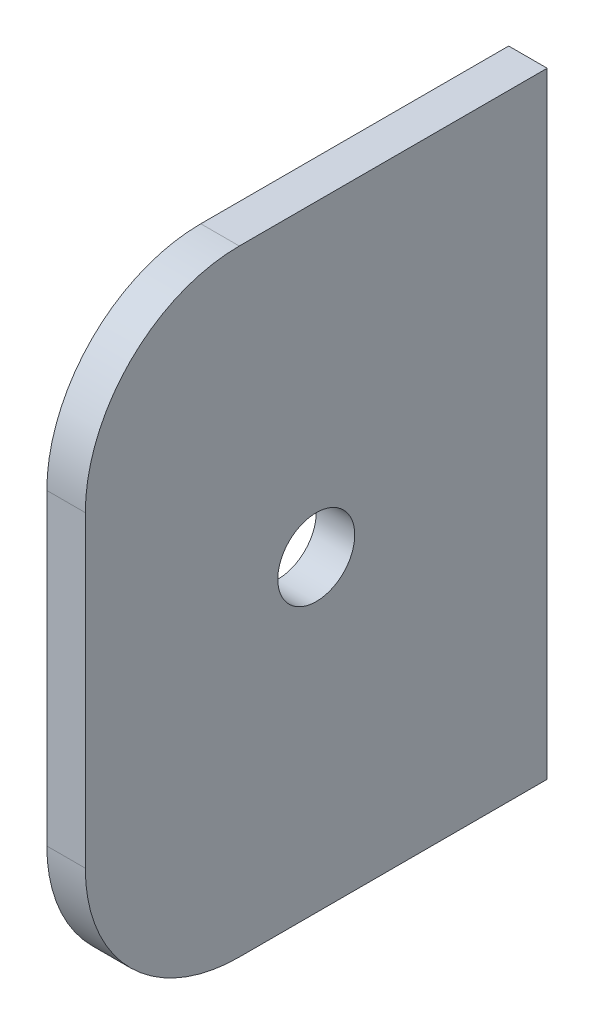
ISO-10303-21;
HEADER;
FILE_DESCRIPTION(('STEP AP214'),'2;1');
FILE_NAME('part.step','',(''),(''),'','','');
FILE_SCHEMA(('AUTOMOTIVE_DESIGN { 1 0 10303 214 1 1 1 1 }'));
ENDSEC;
DATA;
#1=APPLICATION_CONTEXT('core data for automotive mechanical design processes');
#2=APPLICATION_PROTOCOL_DEFINITION('international standard','automotive_design',2000,#1);
#3=PRODUCT_CONTEXT('',#1,'mechanical');
#4=PRODUCT('Part','Part','',(#3));
#5=PRODUCT_RELATED_PRODUCT_CATEGORY('part','',(#4));
#6=PRODUCT_DEFINITION_FORMATION('','',#4);
#7=PRODUCT_DEFINITION_CONTEXT('part definition',#1,'design');
#8=PRODUCT_DEFINITION('design','',#6,#7);
#9=PRODUCT_DEFINITION_SHAPE('','',#8);
#10=(LENGTH_UNIT() NAMED_UNIT(*) SI_UNIT(.MILLI.,.METRE.));
#11=(NAMED_UNIT(*) PLANE_ANGLE_UNIT() SI_UNIT($,.RADIAN.));
#12=(NAMED_UNIT(*) SI_UNIT($,.STERADIAN.) SOLID_ANGLE_UNIT());
#13=UNCERTAINTY_MEASURE_WITH_UNIT(LENGTH_MEASURE(1.E-05),#10,'distance_accuracy_value','');
#14=(GEOMETRIC_REPRESENTATION_CONTEXT(3) GLOBAL_UNCERTAINTY_ASSIGNED_CONTEXT((#13)) GLOBAL_UNIT_ASSIGNED_CONTEXT((#10,
#11,#12)) REPRESENTATION_CONTEXT('',''));
#15=CARTESIAN_POINT('',(0.,0.,0.));
#16=DIRECTION('',(0.,0.,1.));
#17=DIRECTION('',(1.,0.,0.));
#18=AXIS2_PLACEMENT_3D('',#15,#16,#17);
#19=CARTESIAN_POINT('',(19.05,1.016,38.1));
#20=DIRECTION('',(0.,-1.,0.));
#21=DIRECTION('',(1.,0.,0.));
#22=AXIS2_PLACEMENT_3D('',#19,#20,#21);
#23=PLANE('',#22);
#24=DIRECTION('',(0.,0.,-1.));
#25=VECTOR('',#24,1.);
#26=CARTESIAN_POINT('',(15.875,1.016,38.1));
#27=LINE('',#26,#25);
#28=CARTESIAN_POINT('',(15.875,1.016,25.4));
#29=VERTEX_POINT('',#28);
#30=CARTESIAN_POINT('',(15.875,1.016,0.));
#31=VERTEX_POINT('',#30);
#32=EDGE_CURVE('E88',#29,#31,#27,.T.);
#33=ORIENTED_EDGE('',*,*,#32,.F.);
#34=DIRECTION('',(-1.,0.,0.));
#35=VECTOR('',#34,1.);
#36=CARTESIAN_POINT('',(19.05,1.016,25.4));
#37=LINE('',#36,#35);
#38=CARTESIAN_POINT('',(19.05,1.016,25.4));
#39=VERTEX_POINT('',#38);
#40=EDGE_CURVE('E57',#29,#39,#37,.F.);
#41=ORIENTED_EDGE('',*,*,#40,.T.);
#42=DIRECTION('',(0.,0.,-1.));
#43=VECTOR('',#42,1.);
#44=CARTESIAN_POINT('',(19.05,1.016,38.1));
#45=LINE('',#44,#43);
#46=CARTESIAN_POINT('',(19.05,1.016,0.));
#47=VERTEX_POINT('',#46);
#48=EDGE_CURVE('E109',#39,#47,#45,.T.);
#49=ORIENTED_EDGE('',*,*,#48,.T.);
#50=DIRECTION('',(-1.,0.,0.));
#51=VECTOR('',#50,1.);
#52=CARTESIAN_POINT('',(19.05,1.016,0.));
#53=LINE('',#52,#51);
#54=EDGE_CURVE('E104',#47,#31,#53,.T.);
#55=ORIENTED_EDGE('',*,*,#54,.T.);
#56=EDGE_LOOP('',(#33,#41,#49,#55));
#57=FACE_BOUND('',#56,.T.);
#58=ADVANCED_FACE('F34',(#57),#23,.F.);
#59=CARTESIAN_POINT('',(15.875,1.016,38.1));
#60=DIRECTION('',(1.,0.,0.));
#61=DIRECTION('',(0.,1.,0.));
#62=AXIS2_PLACEMENT_3D('',#59,#60,#61);
#63=PLANE('',#62);
#64=CARTESIAN_POINT('',(15.875,-24.384,19.05));
#65=DIRECTION('',(-1.,0.,0.));
#66=DIRECTION('',(0.,-1.,0.));
#67=AXIS2_PLACEMENT_3D('',#64,#65,#66);
#68=CIRCLE('',#67,3.175);
#69=CARTESIAN_POINT('',(15.875,-27.559,19.05));
#70=VERTEX_POINT('',#69);
#71=EDGE_CURVE('E113',#70,#70,#68,.T.);
#72=ORIENTED_EDGE('',*,*,#71,.F.);
#73=EDGE_LOOP('',(#72));
#74=FACE_BOUND('',#73,.T.);
#75=DIRECTION('',(0.,-1.,0.));
#76=VECTOR('',#75,1.);
#77=CARTESIAN_POINT('',(15.875,1.016,38.1));
#78=LINE('',#77,#76);
#79=CARTESIAN_POINT('',(15.875,-11.684,38.1));
#80=VERTEX_POINT('',#79);
#81=CARTESIAN_POINT('',(15.875,-37.084,38.1));
#82=VERTEX_POINT('',#81);
#83=EDGE_CURVE('E122',#80,#82,#78,.T.);
#84=ORIENTED_EDGE('',*,*,#83,.F.);
#85=CARTESIAN_POINT('',(15.875,-11.684,25.4));
#86=DIRECTION('',(1.,0.,0.));
#87=DIRECTION('',(0.,1.,0.));
#88=AXIS2_PLACEMENT_3D('',#85,#86,#87);
#89=CIRCLE('',#88,12.7);
#90=EDGE_CURVE('E95',#80,#29,#89,.F.);
#91=ORIENTED_EDGE('',*,*,#90,.T.);
#92=ORIENTED_EDGE('',*,*,#32,.T.);
#93=DIRECTION('',(0.,-1.,0.));
#94=VECTOR('',#93,1.);
#95=CARTESIAN_POINT('',(15.875,1.016,0.));
#96=LINE('',#95,#94);
#97=CARTESIAN_POINT('',(15.875,-49.784,0.));
#98=VERTEX_POINT('',#97);
#99=EDGE_CURVE('E93',#31,#98,#96,.T.);
#100=ORIENTED_EDGE('',*,*,#99,.T.);
#101=DIRECTION('',(0.,0.,-1.));
#102=VECTOR('',#101,1.);
#103=CARTESIAN_POINT('',(15.875,-49.784,38.1));
#104=LINE('',#103,#102);
#105=CARTESIAN_POINT('',(15.875,-49.784,25.4));
#106=VERTEX_POINT('',#105);
#107=EDGE_CURVE('E98',#106,#98,#104,.T.);
#108=ORIENTED_EDGE('',*,*,#107,.F.);
#109=CARTESIAN_POINT('',(15.875,-37.084,25.4));
#110=DIRECTION('',(1.,0.,0.));
#111=DIRECTION('',(0.,1.,0.));
#112=AXIS2_PLACEMENT_3D('',#109,#110,#111);
#113=CIRCLE('',#112,12.7);
#114=EDGE_CURVE('E131',#106,#82,#113,.F.);
#115=ORIENTED_EDGE('',*,*,#114,.T.);
#116=EDGE_LOOP('',(#84,#91,#92,#100,#108,#115));
#117=FACE_BOUND('',#116,.T.);
#118=ADVANCED_FACE('F91',(#74,#117),#63,.F.);
#119=CARTESIAN_POINT('',(19.05,-49.784,38.1));
#120=DIRECTION('',(0.,-1.,0.));
#121=DIRECTION('',(0.,0.,-1.));
#122=AXIS2_PLACEMENT_3D('',#119,#120,#121);
#123=PLANE('',#122);
#124=DIRECTION('',(0.,0.,-1.));
#125=VECTOR('',#124,1.);
#126=CARTESIAN_POINT('',(19.05,-49.784,38.1));
#127=LINE('',#126,#125);
#128=CARTESIAN_POINT('',(19.05,-49.784,25.4));
#129=VERTEX_POINT('',#128);
#130=CARTESIAN_POINT('',(19.05,-49.784,0.));
#131=VERTEX_POINT('',#130);
#132=EDGE_CURVE('E124',#129,#131,#127,.T.);
#133=ORIENTED_EDGE('',*,*,#132,.F.);
#134=DIRECTION('',(-1.,0.,0.));
#135=VECTOR('',#134,1.);
#136=CARTESIAN_POINT('',(19.05,-49.784,25.4));
#137=LINE('',#136,#135);
#138=EDGE_CURVE('E11',#129,#106,#137,.T.);
#139=ORIENTED_EDGE('',*,*,#138,.T.);
#140=ORIENTED_EDGE('',*,*,#107,.T.);
#141=DIRECTION('',(-1.,0.,0.));
#142=VECTOR('',#141,1.);
#143=CARTESIAN_POINT('',(19.05,-49.784,0.));
#144=LINE('',#143,#142);
#145=EDGE_CURVE('E107',#131,#98,#144,.T.);
#146=ORIENTED_EDGE('',*,*,#145,.F.);
#147=EDGE_LOOP('',(#133,#139,#140,#146));
#148=FACE_BOUND('',#147,.T.);
#149=ADVANCED_FACE('F159',(#148),#123,.T.);
#150=CARTESIAN_POINT('',(19.05,1.016,38.1));
#151=DIRECTION('',(1.,0.,0.));
#152=DIRECTION('',(0.,0.,-1.));
#153=AXIS2_PLACEMENT_3D('',#150,#151,#152);
#154=PLANE('',#153);
#155=CARTESIAN_POINT('',(19.05,-24.384,19.05));
#156=DIRECTION('',(1.,0.,0.));
#157=DIRECTION('',(0.,0.,-1.));
#158=AXIS2_PLACEMENT_3D('',#155,#156,#157);
#159=CIRCLE('',#158,3.175);
#160=CARTESIAN_POINT('',(19.05,-24.384,15.875));
#161=VERTEX_POINT('',#160);
#162=EDGE_CURVE('E110',#161,#161,#159,.T.);
#163=ORIENTED_EDGE('',*,*,#162,.F.);
#164=EDGE_LOOP('',(#163));
#165=FACE_BOUND('',#164,.T.);
#166=ORIENTED_EDGE('',*,*,#48,.F.);
#167=CARTESIAN_POINT('',(19.05,-11.684,25.4));
#168=DIRECTION('',(1.,0.,0.));
#169=DIRECTION('',(0.,0.,-1.));
#170=AXIS2_PLACEMENT_3D('',#167,#168,#169);
#171=CIRCLE('',#170,12.7);
#172=CARTESIAN_POINT('',(19.05,-11.684,38.1));
#173=VERTEX_POINT('',#172);
#174=EDGE_CURVE('E42',#39,#173,#171,.T.);
#175=ORIENTED_EDGE('',*,*,#174,.T.);
#176=DIRECTION('',(0.,-1.,0.));
#177=VECTOR('',#176,1.);
#178=CARTESIAN_POINT('',(19.05,1.016,38.1));
#179=LINE('',#178,#177);
#180=CARTESIAN_POINT('',(19.05,-37.084,38.1));
#181=VERTEX_POINT('',#180);
#182=EDGE_CURVE('E116',#173,#181,#179,.T.);
#183=ORIENTED_EDGE('',*,*,#182,.T.);
#184=CARTESIAN_POINT('',(19.05,-37.084,25.4));
#185=DIRECTION('',(1.,0.,0.));
#186=DIRECTION('',(0.,0.,-1.));
#187=AXIS2_PLACEMENT_3D('',#184,#185,#186);
#188=CIRCLE('',#187,12.7);
#189=EDGE_CURVE('E49',#181,#129,#188,.T.);
#190=ORIENTED_EDGE('',*,*,#189,.T.);
#191=ORIENTED_EDGE('',*,*,#132,.T.);
#192=DIRECTION('',(0.,-1.,0.));
#193=VECTOR('',#192,1.);
#194=CARTESIAN_POINT('',(19.05,1.016,0.));
#195=LINE('',#194,#193);
#196=EDGE_CURVE('E120',#47,#131,#195,.T.);
#197=ORIENTED_EDGE('',*,*,#196,.F.);
#198=EDGE_LOOP('',(#166,#175,#183,#190,#191,#197));
#199=FACE_BOUND('',#198,.T.);
#200=ADVANCED_FACE('F137',(#165,#199),#154,.T.);
#201=CARTESIAN_POINT('',(0.,0.,38.1));
#202=DIRECTION('',(0.,0.,1.));
#203=DIRECTION('',(1.,0.,0.));
#204=AXIS2_PLACEMENT_3D('',#201,#202,#203);
#205=PLANE('',#204);
#206=ORIENTED_EDGE('',*,*,#182,.F.);
#207=DIRECTION('',(-1.,0.,0.));
#208=VECTOR('',#207,1.);
#209=CARTESIAN_POINT('',(15.875,-11.684,38.1));
#210=LINE('',#209,#208);
#211=EDGE_CURVE('E128',#173,#80,#210,.T.);
#212=ORIENTED_EDGE('',*,*,#211,.T.);
#213=ORIENTED_EDGE('',*,*,#83,.T.);
#214=DIRECTION('',(-1.,0.,0.));
#215=VECTOR('',#214,1.);
#216=CARTESIAN_POINT('',(0.,-37.084,38.1));
#217=LINE('',#216,#215);
#218=EDGE_CURVE('E97',#82,#181,#217,.F.);
#219=ORIENTED_EDGE('',*,*,#218,.T.);
#220=EDGE_LOOP('',(#206,#212,#213,#219));
#221=FACE_BOUND('',#220,.T.);
#222=ADVANCED_FACE('F141',(#221),#205,.T.);
#223=CARTESIAN_POINT('',(0.,0.,0.));
#224=DIRECTION('',(0.,0.,1.));
#225=DIRECTION('',(1.,0.,0.));
#226=AXIS2_PLACEMENT_3D('',#223,#224,#225);
#227=PLANE('',#226);
#228=ORIENTED_EDGE('',*,*,#54,.F.);
#229=ORIENTED_EDGE('',*,*,#196,.T.);
#230=ORIENTED_EDGE('',*,*,#145,.T.);
#231=ORIENTED_EDGE('',*,*,#99,.F.);
#232=EDGE_LOOP('',(#228,#229,#230,#231));
#233=FACE_BOUND('',#232,.T.);
#234=ADVANCED_FACE('F102',(#233),#227,.F.);
#235=CARTESIAN_POINT('',(53.975,-24.384,19.05));
#236=DIRECTION('',(-1.,0.,0.));
#237=DIRECTION('',(0.,-1.,0.));
#238=AXIS2_PLACEMENT_3D('',#235,#236,#237);
#239=CYLINDRICAL_SURFACE('',#238,3.175);
#240=ORIENTED_EDGE('',*,*,#162,.T.);
#241=EDGE_LOOP('',(#240));
#242=FACE_BOUND('',#241,.T.);
#243=ORIENTED_EDGE('',*,*,#71,.T.);
#244=EDGE_LOOP('',(#243));
#245=FACE_BOUND('',#244,.T.);
#246=ADVANCED_FACE('F146',(#242,#245),#239,.F.);
#247=CARTESIAN_POINT('',(0.,-11.684,25.4));
#248=DIRECTION('',(1.,0.,0.));
#249=DIRECTION('',(0.,1.,0.));
#250=AXIS2_PLACEMENT_3D('',#247,#248,#249);
#251=CYLINDRICAL_SURFACE('',#250,12.7);
#252=ORIENTED_EDGE('',*,*,#174,.F.);
#253=ORIENTED_EDGE('',*,*,#40,.F.);
#254=ORIENTED_EDGE('',*,*,#90,.F.);
#255=ORIENTED_EDGE('',*,*,#211,.F.);
#256=EDGE_LOOP('',(#252,#253,#254,#255));
#257=FACE_BOUND('',#256,.T.);
#258=ADVANCED_FACE('F144',(#257),#251,.T.);
#259=CARTESIAN_POINT('',(19.05,-37.084,25.4));
#260=DIRECTION('',(-1.,0.,0.));
#261=DIRECTION('',(0.,0.,1.));
#262=AXIS2_PLACEMENT_3D('',#259,#260,#261);
#263=CYLINDRICAL_SURFACE('',#262,12.7);
#264=ORIENTED_EDGE('',*,*,#189,.F.);
#265=ORIENTED_EDGE('',*,*,#218,.F.);
#266=ORIENTED_EDGE('',*,*,#114,.F.);
#267=ORIENTED_EDGE('',*,*,#138,.F.);
#268=EDGE_LOOP('',(#264,#265,#266,#267));
#269=FACE_BOUND('',#268,.T.);
#270=ADVANCED_FACE('F36',(#269),#263,.T.);
#271=CLOSED_SHELL('',(#58,#118,#149,#200,#222,#234,#246,#258,#270));
#272=MANIFOLD_SOLID_BREP('B2',#271);
#273=ADVANCED_BREP_SHAPE_REPRESENTATION('',(#18,#272),#14);
#274=SHAPE_DEFINITION_REPRESENTATION(#9,#273);
ENDSEC;
END-ISO-10303-21;
